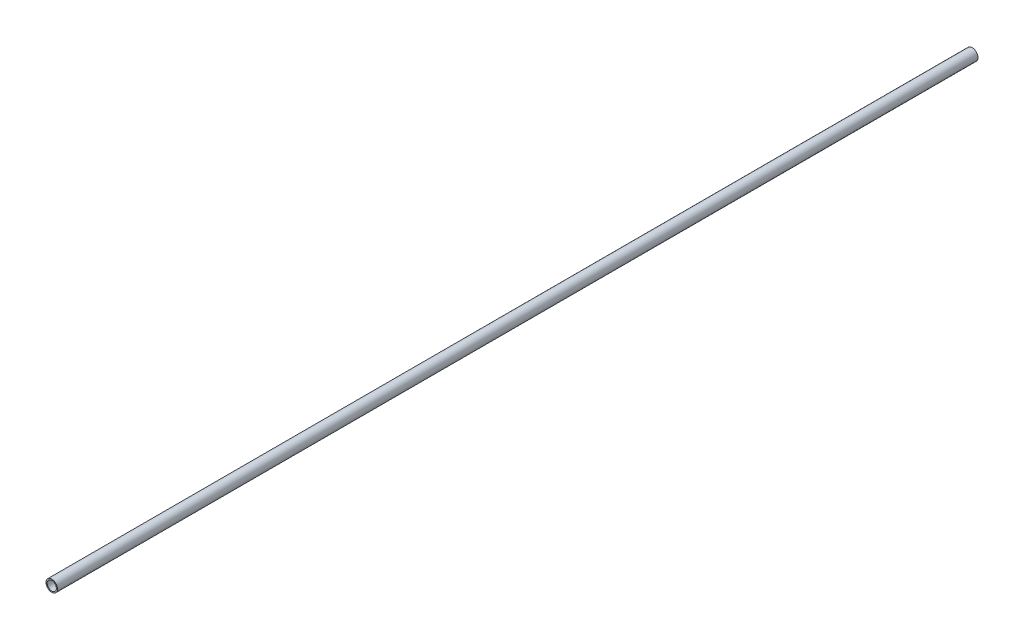
ISO-10303-21;
HEADER;
FILE_DESCRIPTION(('STEP AP214'),'2;1');
FILE_NAME('part.step','',(''),(''),'','','');
FILE_SCHEMA(('AUTOMOTIVE_DESIGN { 1 0 10303 214 1 1 1 1 }'));
ENDSEC;
DATA;
#1=APPLICATION_CONTEXT('core data for automotive mechanical design processes');
#2=APPLICATION_PROTOCOL_DEFINITION('international standard','automotive_design',2000,#1);
#3=PRODUCT_CONTEXT('',#1,'mechanical');
#4=PRODUCT('Part','Part','',(#3));
#5=PRODUCT_RELATED_PRODUCT_CATEGORY('part','',(#4));
#6=PRODUCT_DEFINITION_FORMATION('','',#4);
#7=PRODUCT_DEFINITION_CONTEXT('part definition',#1,'design');
#8=PRODUCT_DEFINITION('design','',#6,#7);
#9=PRODUCT_DEFINITION_SHAPE('','',#8);
#10=(LENGTH_UNIT() NAMED_UNIT(*) SI_UNIT(.MILLI.,.METRE.));
#11=(NAMED_UNIT(*) PLANE_ANGLE_UNIT() SI_UNIT($,.RADIAN.));
#12=(NAMED_UNIT(*) SI_UNIT($,.STERADIAN.) SOLID_ANGLE_UNIT());
#13=UNCERTAINTY_MEASURE_WITH_UNIT(LENGTH_MEASURE(1.E-05),#10,'distance_accuracy_value','');
#14=(GEOMETRIC_REPRESENTATION_CONTEXT(3) GLOBAL_UNCERTAINTY_ASSIGNED_CONTEXT((#13)) GLOBAL_UNIT_ASSIGNED_CONTEXT((#10,
#11,#12)) REPRESENTATION_CONTEXT('',''));
#15=CARTESIAN_POINT('',(0.,0.,0.));
#16=DIRECTION('',(0.,0.,1.));
#17=DIRECTION('',(1.,0.,0.));
#18=AXIS2_PLACEMENT_3D('',#15,#16,#17);
#19=CARTESIAN_POINT('',(0.,0.,800.));
#20=DIRECTION('',(0.,0.,1.));
#21=DIRECTION('',(1.,0.,0.));
#22=AXIS2_PLACEMENT_3D('',#19,#20,#21);
#23=PLANE('',#22);
#24=CARTESIAN_POINT('',(0.,0.,800.));
#25=DIRECTION('',(0.,0.,1.));
#26=DIRECTION('',(1.,0.,0.));
#27=AXIS2_PLACEMENT_3D('',#24,#25,#26);
#28=CIRCLE('',#27,5.);
#29=CARTESIAN_POINT('',(5.,0.,800.));
#30=VERTEX_POINT('',#29);
#31=EDGE_CURVE('E10',#30,#30,#28,.T.);
#32=ORIENTED_EDGE('',*,*,#31,.T.);
#33=EDGE_LOOP('',(#32));
#34=FACE_BOUND('',#33,.T.);
#35=CARTESIAN_POINT('',(0.,0.,800.));
#36=DIRECTION('',(0.,0.,1.));
#37=DIRECTION('',(1.,0.,0.));
#38=AXIS2_PLACEMENT_3D('',#35,#36,#37);
#39=CIRCLE('',#38,4.);
#40=CARTESIAN_POINT('',(4.,0.,800.));
#41=VERTEX_POINT('',#40);
#42=EDGE_CURVE('E52',#41,#41,#39,.T.);
#43=ORIENTED_EDGE('',*,*,#42,.F.);
#44=EDGE_LOOP('',(#43));
#45=FACE_BOUND('',#44,.T.);
#46=ADVANCED_FACE('F39',(#34,#45),#23,.T.);
#47=CARTESIAN_POINT('',(0.,0.,0.));
#48=DIRECTION('',(0.,0.,1.));
#49=DIRECTION('',(1.,0.,0.));
#50=AXIS2_PLACEMENT_3D('',#47,#48,#49);
#51=PLANE('',#50);
#52=CARTESIAN_POINT('',(0.,0.,0.));
#53=DIRECTION('',(0.,0.,1.));
#54=DIRECTION('',(1.,0.,0.));
#55=AXIS2_PLACEMENT_3D('',#52,#53,#54);
#56=CIRCLE('',#55,5.);
#57=CARTESIAN_POINT('',(5.,0.,0.));
#58=VERTEX_POINT('',#57);
#59=EDGE_CURVE('E43',#58,#58,#56,.T.);
#60=ORIENTED_EDGE('',*,*,#59,.F.);
#61=EDGE_LOOP('',(#60));
#62=FACE_BOUND('',#61,.T.);
#63=CARTESIAN_POINT('',(0.,0.,0.));
#64=DIRECTION('',(0.,0.,1.));
#65=DIRECTION('',(1.,0.,0.));
#66=AXIS2_PLACEMENT_3D('',#63,#64,#65);
#67=CIRCLE('',#66,4.);
#68=CARTESIAN_POINT('',(4.,0.,0.));
#69=VERTEX_POINT('',#68);
#70=EDGE_CURVE('E54',#69,#69,#67,.T.);
#71=ORIENTED_EDGE('',*,*,#70,.T.);
#72=EDGE_LOOP('',(#71));
#73=FACE_BOUND('',#72,.T.);
#74=ADVANCED_FACE('F66',(#62,#73),#51,.F.);
#75=CARTESIAN_POINT('',(0.,0.,800.));
#76=DIRECTION('',(0.,0.,-1.));
#77=DIRECTION('',(-1.,0.,0.));
#78=AXIS2_PLACEMENT_3D('',#75,#76,#77);
#79=CYLINDRICAL_SURFACE('',#78,5.);
#80=ORIENTED_EDGE('',*,*,#31,.F.);
#81=EDGE_LOOP('',(#80));
#82=FACE_BOUND('',#81,.T.);
#83=ORIENTED_EDGE('',*,*,#59,.T.);
#84=EDGE_LOOP('',(#83));
#85=FACE_BOUND('',#84,.T.);
#86=ADVANCED_FACE('F41',(#82,#85),#79,.T.);
#87=CARTESIAN_POINT('',(0.,0.,800.));
#88=DIRECTION('',(0.,0.,-1.));
#89=DIRECTION('',(-1.,0.,0.));
#90=AXIS2_PLACEMENT_3D('',#87,#88,#89);
#91=CYLINDRICAL_SURFACE('',#90,4.);
#92=ORIENTED_EDGE('',*,*,#42,.T.);
#93=EDGE_LOOP('',(#92));
#94=FACE_BOUND('',#93,.T.);
#95=ORIENTED_EDGE('',*,*,#70,.F.);
#96=EDGE_LOOP('',(#95));
#97=FACE_BOUND('',#96,.T.);
#98=ADVANCED_FACE('F62',(#94,#97),#91,.F.);
#99=CLOSED_SHELL('',(#46,#74,#86,#98));
#100=MANIFOLD_SOLID_BREP('B2',#99);
#101=ADVANCED_BREP_SHAPE_REPRESENTATION('',(#18,#100),#14);
#102=SHAPE_DEFINITION_REPRESENTATION(#9,#101);
ENDSEC;
END-ISO-10303-21;
